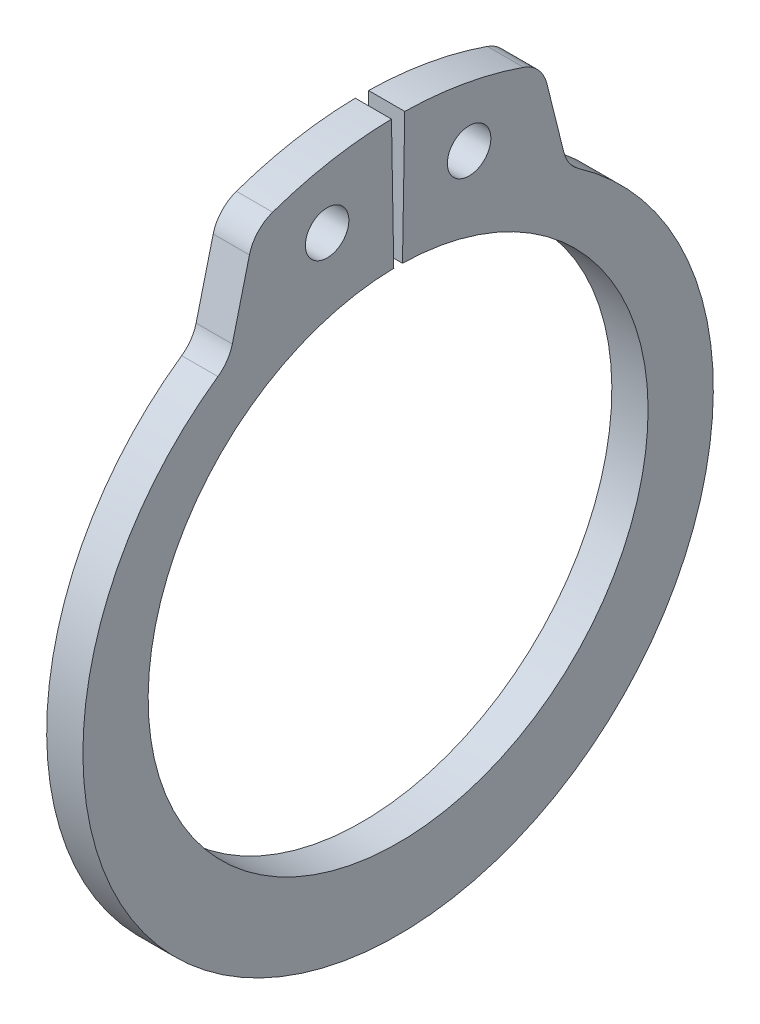
ISO-10303-21;
HEADER;
FILE_DESCRIPTION(('STEP AP214'),'2;1');
FILE_NAME('part.step','',(''),(''),'','','');
FILE_SCHEMA(('AUTOMOTIVE_DESIGN { 1 0 10303 214 1 1 1 1 }'));
ENDSEC;
DATA;
#1=APPLICATION_CONTEXT('core data for automotive mechanical design processes');
#2=APPLICATION_PROTOCOL_DEFINITION('international standard','automotive_design',2000,#1);
#3=PRODUCT_CONTEXT('',#1,'mechanical');
#4=PRODUCT('Part','Part','',(#3));
#5=PRODUCT_RELATED_PRODUCT_CATEGORY('part','',(#4));
#6=PRODUCT_DEFINITION_FORMATION('','',#4);
#7=PRODUCT_DEFINITION_CONTEXT('part definition',#1,'design');
#8=PRODUCT_DEFINITION('design','',#6,#7);
#9=PRODUCT_DEFINITION_SHAPE('','',#8);
#10=(LENGTH_UNIT() NAMED_UNIT(*) SI_UNIT(.MILLI.,.METRE.));
#11=(NAMED_UNIT(*) PLANE_ANGLE_UNIT() SI_UNIT($,.RADIAN.));
#12=(NAMED_UNIT(*) SI_UNIT($,.STERADIAN.) SOLID_ANGLE_UNIT());
#13=UNCERTAINTY_MEASURE_WITH_UNIT(LENGTH_MEASURE(1.E-05),#10,'distance_accuracy_value','');
#14=(GEOMETRIC_REPRESENTATION_CONTEXT(3) GLOBAL_UNCERTAINTY_ASSIGNED_CONTEXT((#13)) GLOBAL_UNIT_ASSIGNED_CONTEXT((#10,
#11,#12)) REPRESENTATION_CONTEXT('',''));
#15=CARTESIAN_POINT('',(0.,0.,0.));
#16=DIRECTION('',(0.,0.,1.));
#17=DIRECTION('',(1.,0.,0.));
#18=AXIS2_PLACEMENT_3D('',#15,#16,#17);
#19=CARTESIAN_POINT('',(-0.5,0.,0.));
#20=DIRECTION('',(1.,0.,0.));
#21=DIRECTION('',(0.,0.,-1.));
#22=AXIS2_PLACEMENT_3D('',#19,#20,#21);
#23=PLANE('',#22);
#24=CARTESIAN_POINT('',(-0.5,8.66711980549086,-1.9596288316201));
#25=DIRECTION('',(-1.,0.,0.));
#26=DIRECTION('',(0.,0.,1.));
#27=AXIS2_PLACEMENT_3D('',#24,#25,#26);
#28=CIRCLE('',#27,0.6);
#29=CARTESIAN_POINT('',(-0.5,8.66711980549086,-1.3596288316201));
#30=VERTEX_POINT('',#29);
#31=EDGE_CURVE('E125',#30,#30,#28,.F.);
#32=ORIENTED_EDGE('',*,*,#31,.T.);
#33=EDGE_LOOP('',(#32));
#34=FACE_BOUND('',#33,.T.);
#35=CARTESIAN_POINT('',(-0.5,8.96816184312502,3.13401869099666));
#36=DIRECTION('',(-1.,0.,0.));
#37=DIRECTION('',(0.,0.,1.));
#38=AXIS2_PLACEMENT_3D('',#35,#36,#37);
#39=CIRCLE('',#38,1.);
#40=CARTESIAN_POINT('',(-0.5,9.91217887924345,3.46391539531209));
#41=VERTEX_POINT('',#40);
#42=CARTESIAN_POINT('',(-0.5,9.21008373872469,4.10431441727265));
#43=VERTEX_POINT('',#42);
#44=EDGE_CURVE('E111',#41,#43,#39,.F.);
#45=ORIENTED_EDGE('',*,*,#44,.F.);
#46=CARTESIAN_POINT('',(-0.5,0.,0.));
#47=DIRECTION('',(-1.,0.,0.));
#48=DIRECTION('',(0.,0.,1.));
#49=AXIS2_PLACEMENT_3D('',#46,#47,#48);
#50=CIRCLE('',#49,10.5);
#51=CARTESIAN_POINT('',(-0.5,10.4984007991421,0.183250267591477));
#52=VERTEX_POINT('',#51);
#53=EDGE_CURVE('E104',#52,#41,#50,.F.);
#54=ORIENTED_EDGE('',*,*,#53,.F.);
#55=DIRECTION('',(0.,-0.999847695156391,-0.0174524064372835));
#56=VECTOR('',#55,1.);
#57=CARTESIAN_POINT('',(-0.5,6.8989490965791,0.120421604417256));
#58=LINE('',#57,#56);
#59=CARTESIAN_POINT('',(-0.5,6.8989490965791,0.120421604417256));
#60=VERTEX_POINT('',#59);
#61=EDGE_CURVE('E108',#52,#60,#58,.T.);
#62=ORIENTED_EDGE('',*,*,#61,.T.);
#63=CARTESIAN_POINT('',(-0.5,0.,0.));
#64=DIRECTION('',(-1.,0.,0.));
#65=DIRECTION('',(0.,0.,1.));
#66=AXIS2_PLACEMENT_3D('',#63,#64,#65);
#67=CIRCLE('',#66,6.9);
#68=CARTESIAN_POINT('',(-0.5,6.8989490965791,-0.120421604417256));
#69=VERTEX_POINT('',#68);
#70=EDGE_CURVE('E171',#60,#69,#67,.F.);
#71=ORIENTED_EDGE('',*,*,#70,.T.);
#72=DIRECTION('',(0.,0.999847695156391,-0.0174524064372841));
#73=VECTOR('',#72,1.);
#74=CARTESIAN_POINT('',(-0.5,10.4984007991421,-0.183250267591479));
#75=LINE('',#74,#73);
#76=CARTESIAN_POINT('',(-0.5,10.4984007991421,-0.183250267591479));
#77=VERTEX_POINT('',#76);
#78=EDGE_CURVE('E133',#69,#77,#75,.T.);
#79=ORIENTED_EDGE('',*,*,#78,.T.);
#80=CARTESIAN_POINT('',(-0.5,0.,0.));
#81=DIRECTION('',(-1.,0.,0.));
#82=DIRECTION('',(0.,0.,1.));
#83=AXIS2_PLACEMENT_3D('',#80,#81,#82);
#84=CIRCLE('',#83,10.5);
#85=CARTESIAN_POINT('',(-0.5,9.91217887924345,-3.46391539531209));
#86=VERTEX_POINT('',#85);
#87=EDGE_CURVE('E173',#86,#77,#84,.F.);
#88=ORIENTED_EDGE('',*,*,#87,.F.);
#89=CARTESIAN_POINT('',(-0.5,8.96816184312502,-3.13401869099665));
#90=DIRECTION('',(-1.,0.,0.));
#91=DIRECTION('',(0.,0.,1.));
#92=AXIS2_PLACEMENT_3D('',#89,#90,#91);
#93=CIRCLE('',#92,1.);
#94=CARTESIAN_POINT('',(-0.5,9.21008373872469,-4.10431441727265));
#95=VERTEX_POINT('',#94);
#96=EDGE_CURVE('E176',#95,#86,#93,.F.);
#97=ORIENTED_EDGE('',*,*,#96,.F.);
#98=DIRECTION('',(0.,-0.970295726275997,-0.241921895599666));
#99=VECTOR('',#98,1.);
#100=CARTESIAN_POINT('',(-0.5,9.71734472745919,-3.97784004803122));
#101=LINE('',#100,#99);
#102=CARTESIAN_POINT('',(-0.5,7.31761530924591,-4.57615979123836));
#103=VERTEX_POINT('',#102);
#104=EDGE_CURVE('E138',#95,#103,#101,.T.);
#105=ORIENTED_EDGE('',*,*,#104,.T.);
#106=CARTESIAN_POINT('',(-0.5,7.55953720484558,-5.54645551751436));
#107=DIRECTION('',(-1.,0.,0.));
#108=DIRECTION('',(0.,0.,1.));
#109=AXIS2_PLACEMENT_3D('',#106,#107,#108);
#110=CIRCLE('',#109,1.);
#111=CARTESIAN_POINT('',(-0.5,6.73911195964233,-4.97470170945253));
#112=VERTEX_POINT('',#111);
#113=EDGE_CURVE('E178',#103,#112,#110,.F.);
#114=ORIENTED_EDGE('',*,*,#113,.T.);
#115=CARTESIAN_POINT('',(-0.5,-0.399224177769538,0.));
#116=DIRECTION('',(-1.,0.,0.));
#117=DIRECTION('',(0.,0.,1.));
#118=AXIS2_PLACEMENT_3D('',#115,#116,#117);
#119=CIRCLE('',#118,8.70077582223046);
#120=CARTESIAN_POINT('',(-0.5,6.73911195964233,4.97470170945253));
#121=VERTEX_POINT('',#120);
#122=EDGE_CURVE('E181',#121,#112,#119,.F.);
#123=ORIENTED_EDGE('',*,*,#122,.F.);
#124=CARTESIAN_POINT('',(-0.5,7.55953720484558,5.54645551751436));
#125=DIRECTION('',(-1.,0.,0.));
#126=DIRECTION('',(0.,0.,1.));
#127=AXIS2_PLACEMENT_3D('',#124,#125,#126);
#128=CIRCLE('',#127,1.);
#129=CARTESIAN_POINT('',(-0.5,7.31761530924591,4.57615979123836));
#130=VERTEX_POINT('',#129);
#131=EDGE_CURVE('E144',#121,#130,#128,.F.);
#132=ORIENTED_EDGE('',*,*,#131,.T.);
#133=DIRECTION('',(0.,0.970295726275997,-0.241921895599665));
#134=VECTOR('',#133,1.);
#135=CARTESIAN_POINT('',(-0.5,9.71734472745919,3.97784004803122));
#136=LINE('',#135,#134);
#137=EDGE_CURVE('E143',#130,#43,#136,.T.);
#138=ORIENTED_EDGE('',*,*,#137,.T.);
#139=EDGE_LOOP('',(#45,#54,#62,#71,#79,#88,#97,#105,#114,#123,#132,#138));
#140=FACE_BOUND('',#139,.T.);
#141=CARTESIAN_POINT('',(-0.5,8.66711980549086,1.9596288316201));
#142=DIRECTION('',(-1.,0.,0.));
#143=DIRECTION('',(0.,0.,1.));
#144=AXIS2_PLACEMENT_3D('',#141,#142,#143);
#145=CIRCLE('',#144,0.6);
#146=CARTESIAN_POINT('',(-0.5,8.66711980549086,2.5596288316201));
#147=VERTEX_POINT('',#146);
#148=EDGE_CURVE('E19',#147,#147,#145,.F.);
#149=ORIENTED_EDGE('',*,*,#148,.T.);
#150=EDGE_LOOP('',(#149));
#151=FACE_BOUND('',#150,.T.);
#152=ADVANCED_FACE('F16',(#34,#140,#151),#23,.F.);
#153=CARTESIAN_POINT('',(0.5,8.66711980549086,1.9596288316201));
#154=DIRECTION('',(-1.,0.,0.));
#155=DIRECTION('',(0.,0.,1.));
#156=AXIS2_PLACEMENT_3D('',#153,#154,#155);
#157=CYLINDRICAL_SURFACE('',#156,0.6);
#158=CARTESIAN_POINT('',(0.5,8.66711980549086,1.9596288316201));
#159=DIRECTION('',(-1.,0.,0.));
#160=DIRECTION('',(0.,0.,1.));
#161=AXIS2_PLACEMENT_3D('',#158,#159,#160);
#162=CIRCLE('',#161,0.6);
#163=CARTESIAN_POINT('',(0.5,8.66711980549086,2.5596288316201));
#164=VERTEX_POINT('',#163);
#165=EDGE_CURVE('E128',#164,#164,#162,.T.);
#166=ORIENTED_EDGE('',*,*,#165,.F.);
#167=EDGE_LOOP('',(#166));
#168=FACE_BOUND('',#167,.T.);
#169=ORIENTED_EDGE('',*,*,#148,.F.);
#170=EDGE_LOOP('',(#169));
#171=FACE_BOUND('',#170,.T.);
#172=ADVANCED_FACE('F271',(#168,#171),#157,.F.);
#173=CARTESIAN_POINT('',(0.5,0.,0.));
#174=DIRECTION('',(-1.,0.,0.));
#175=DIRECTION('',(0.,0.,1.));
#176=AXIS2_PLACEMENT_3D('',#173,#174,#175);
#177=CYLINDRICAL_SURFACE('',#176,10.5);
#178=CARTESIAN_POINT('',(0.5,0.,0.));
#179=DIRECTION('',(-1.,0.,0.));
#180=DIRECTION('',(0.,0.,1.));
#181=AXIS2_PLACEMENT_3D('',#178,#179,#180);
#182=CIRCLE('',#181,10.5);
#183=CARTESIAN_POINT('',(0.5,10.4984007991421,0.183250267591477));
#184=VERTEX_POINT('',#183);
#185=CARTESIAN_POINT('',(0.5,9.91217887924345,3.46391539531209));
#186=VERTEX_POINT('',#185);
#187=EDGE_CURVE('E119',#184,#186,#182,.F.);
#188=ORIENTED_EDGE('',*,*,#187,.F.);
#189=DIRECTION('',(1.,0.,0.));
#190=VECTOR('',#189,1.);
#191=CARTESIAN_POINT('',(0.5,10.4984007991421,0.183250267591477));
#192=LINE('',#191,#190);
#193=EDGE_CURVE('E116',#184,#52,#192,.F.);
#194=ORIENTED_EDGE('',*,*,#193,.T.);
#195=ORIENTED_EDGE('',*,*,#53,.T.);
#196=DIRECTION('',(-1.,0.,0.));
#197=VECTOR('',#196,1.);
#198=CARTESIAN_POINT('',(0.5,9.91217887924345,3.46391539531209));
#199=LINE('',#198,#197);
#200=EDGE_CURVE('E114',#186,#41,#199,.T.);
#201=ORIENTED_EDGE('',*,*,#200,.F.);
#202=EDGE_LOOP('',(#188,#194,#195,#201));
#203=FACE_BOUND('',#202,.T.);
#204=ADVANCED_FACE('F117',(#203),#177,.T.);
#205=CARTESIAN_POINT('',(0.5,8.96816184312502,3.13401869099666));
#206=DIRECTION('',(-1.,0.,0.));
#207=DIRECTION('',(0.,0.,1.));
#208=AXIS2_PLACEMENT_3D('',#205,#206,#207);
#209=CYLINDRICAL_SURFACE('',#208,1.);
#210=ORIENTED_EDGE('',*,*,#44,.T.);
#211=DIRECTION('',(1.,0.,0.));
#212=VECTOR('',#211,1.);
#213=CARTESIAN_POINT('',(0.5,9.21008373872469,4.10431441727265));
#214=LINE('',#213,#212);
#215=CARTESIAN_POINT('',(0.5,9.21008373872469,4.10431441727265));
#216=VERTEX_POINT('',#215);
#217=EDGE_CURVE('E145',#43,#216,#214,.T.);
#218=ORIENTED_EDGE('',*,*,#217,.T.);
#219=CARTESIAN_POINT('',(0.5,8.96816184312502,3.13401869099666));
#220=DIRECTION('',(-1.,0.,0.));
#221=DIRECTION('',(0.,0.,1.));
#222=AXIS2_PLACEMENT_3D('',#219,#220,#221);
#223=CIRCLE('',#222,1.);
#224=EDGE_CURVE('E165',#186,#216,#223,.F.);
#225=ORIENTED_EDGE('',*,*,#224,.F.);
#226=ORIENTED_EDGE('',*,*,#200,.T.);
#227=EDGE_LOOP('',(#210,#218,#225,#226));
#228=FACE_BOUND('',#227,.T.);
#229=ADVANCED_FACE('F189',(#228),#209,.T.);
#230=CARTESIAN_POINT('',(0.5,9.71734472745919,3.97784004803122));
#231=DIRECTION('',(0.,-0.241921895599665,-0.970295726275997));
#232=DIRECTION('',(0.,0.970295726275997,-0.241921895599665));
#233=AXIS2_PLACEMENT_3D('',#230,#231,#232);
#234=PLANE('',#233);
#235=DIRECTION('',(-1.,0.,0.));
#236=VECTOR('',#235,1.);
#237=CARTESIAN_POINT('',(0.5,7.31761530924591,4.57615979123836));
#238=LINE('',#237,#236);
#239=CARTESIAN_POINT('',(0.5,7.31761530924591,4.57615979123836));
#240=VERTEX_POINT('',#239);
#241=EDGE_CURVE('E186',#130,#240,#238,.F.);
#242=ORIENTED_EDGE('',*,*,#241,.T.);
#243=DIRECTION('',(0.,-0.970295726275997,0.241921895599665));
#244=VECTOR('',#243,1.);
#245=CARTESIAN_POINT('',(0.5,9.21008373872469,4.10431441727265));
#246=LINE('',#245,#244);
#247=EDGE_CURVE('E164',#216,#240,#246,.T.);
#248=ORIENTED_EDGE('',*,*,#247,.F.);
#249=ORIENTED_EDGE('',*,*,#217,.F.);
#250=ORIENTED_EDGE('',*,*,#137,.F.);
#251=EDGE_LOOP('',(#242,#248,#249,#250));
#252=FACE_BOUND('',#251,.T.);
#253=ADVANCED_FACE('F217',(#252),#234,.F.);
#254=CARTESIAN_POINT('',(0.5,7.55953720484558,5.54645551751436));
#255=DIRECTION('',(-1.,0.,0.));
#256=DIRECTION('',(0.,0.,1.));
#257=AXIS2_PLACEMENT_3D('',#254,#255,#256);
#258=CYLINDRICAL_SURFACE('',#257,1.);
#259=ORIENTED_EDGE('',*,*,#241,.F.);
#260=ORIENTED_EDGE('',*,*,#131,.F.);
#261=DIRECTION('',(-1.,0.,0.));
#262=VECTOR('',#261,1.);
#263=CARTESIAN_POINT('',(0.5,6.73911195964233,4.97470170945253));
#264=LINE('',#263,#262);
#265=CARTESIAN_POINT('',(0.5,6.73911195964233,4.97470170945253));
#266=VERTEX_POINT('',#265);
#267=EDGE_CURVE('E184',#266,#121,#264,.T.);
#268=ORIENTED_EDGE('',*,*,#267,.F.);
#269=CARTESIAN_POINT('',(0.5,7.55953720484558,5.54645551751436));
#270=DIRECTION('',(-1.,0.,0.));
#271=DIRECTION('',(0.,0.,1.));
#272=AXIS2_PLACEMENT_3D('',#269,#270,#271);
#273=CIRCLE('',#272,1.);
#274=EDGE_CURVE('E161',#240,#266,#273,.T.);
#275=ORIENTED_EDGE('',*,*,#274,.F.);
#276=EDGE_LOOP('',(#259,#260,#268,#275));
#277=FACE_BOUND('',#276,.T.);
#278=ADVANCED_FACE('F220',(#277),#258,.F.);
#279=CARTESIAN_POINT('',(0.5,-0.399224177769538,0.));
#280=DIRECTION('',(-1.,0.,0.));
#281=DIRECTION('',(0.,0.,1.));
#282=AXIS2_PLACEMENT_3D('',#279,#280,#281);
#283=CYLINDRICAL_SURFACE('',#282,8.70077582223046);
#284=ORIENTED_EDGE('',*,*,#122,.T.);
#285=DIRECTION('',(-1.,0.,0.));
#286=VECTOR('',#285,1.);
#287=CARTESIAN_POINT('',(0.5,6.73911195964233,-4.97470170945253));
#288=LINE('',#287,#286);
#289=CARTESIAN_POINT('',(0.5,6.73911195964233,-4.97470170945253));
#290=VERTEX_POINT('',#289);
#291=EDGE_CURVE('E180',#112,#290,#288,.F.);
#292=ORIENTED_EDGE('',*,*,#291,.T.);
#293=CARTESIAN_POINT('',(0.5,-0.399224177769538,0.));
#294=DIRECTION('',(-1.,0.,0.));
#295=DIRECTION('',(0.,0.,1.));
#296=AXIS2_PLACEMENT_3D('',#293,#294,#295);
#297=CIRCLE('',#296,8.70077582223046);
#298=EDGE_CURVE('E159',#266,#290,#297,.F.);
#299=ORIENTED_EDGE('',*,*,#298,.F.);
#300=ORIENTED_EDGE('',*,*,#267,.T.);
#301=EDGE_LOOP('',(#284,#292,#299,#300));
#302=FACE_BOUND('',#301,.T.);
#303=ADVANCED_FACE('F225',(#302),#283,.T.);
#304=CARTESIAN_POINT('',(0.5,7.55953720484558,-5.54645551751436));
#305=DIRECTION('',(-1.,0.,0.));
#306=DIRECTION('',(0.,0.,1.));
#307=AXIS2_PLACEMENT_3D('',#304,#305,#306);
#308=CYLINDRICAL_SURFACE('',#307,1.);
#309=ORIENTED_EDGE('',*,*,#291,.F.);
#310=ORIENTED_EDGE('',*,*,#113,.F.);
#311=DIRECTION('',(1.,0.,0.));
#312=VECTOR('',#311,1.);
#313=CARTESIAN_POINT('',(0.5,7.31761530924591,-4.57615979123836));
#314=LINE('',#313,#312);
#315=CARTESIAN_POINT('',(0.5,7.31761530924591,-4.57615979123836));
#316=VERTEX_POINT('',#315);
#317=EDGE_CURVE('E142',#103,#316,#314,.T.);
#318=ORIENTED_EDGE('',*,*,#317,.T.);
#319=CARTESIAN_POINT('',(0.5,7.55953720484558,-5.54645551751436));
#320=DIRECTION('',(-1.,0.,0.));
#321=DIRECTION('',(0.,0.,1.));
#322=AXIS2_PLACEMENT_3D('',#319,#320,#321);
#323=CIRCLE('',#322,1.);
#324=EDGE_CURVE('E156',#290,#316,#323,.T.);
#325=ORIENTED_EDGE('',*,*,#324,.F.);
#326=EDGE_LOOP('',(#309,#310,#318,#325));
#327=FACE_BOUND('',#326,.T.);
#328=ADVANCED_FACE('F227',(#327),#308,.F.);
#329=CARTESIAN_POINT('',(0.5,9.71734472745919,-3.97784004803122));
#330=DIRECTION('',(0.,-0.241921895599666,0.970295726275997));
#331=DIRECTION('',(0.,-0.970295726275997,-0.241921895599666));
#332=AXIS2_PLACEMENT_3D('',#329,#330,#331);
#333=PLANE('',#332);
#334=DIRECTION('',(-1.,0.,0.));
#335=VECTOR('',#334,1.);
#336=CARTESIAN_POINT('',(0.5,9.21008373872469,-4.10431441727265));
#337=LINE('',#336,#335);
#338=CARTESIAN_POINT('',(0.5,9.21008373872469,-4.10431441727265));
#339=VERTEX_POINT('',#338);
#340=EDGE_CURVE('E141',#339,#95,#337,.T.);
#341=ORIENTED_EDGE('',*,*,#340,.F.);
#342=DIRECTION('',(0.,0.970295726275997,0.241921895599666));
#343=VECTOR('',#342,1.);
#344=CARTESIAN_POINT('',(0.5,7.31761530924591,-4.57615979123836));
#345=LINE('',#344,#343);
#346=EDGE_CURVE('E155',#316,#339,#345,.T.);
#347=ORIENTED_EDGE('',*,*,#346,.F.);
#348=ORIENTED_EDGE('',*,*,#317,.F.);
#349=ORIENTED_EDGE('',*,*,#104,.F.);
#350=EDGE_LOOP('',(#341,#347,#348,#349));
#351=FACE_BOUND('',#350,.T.);
#352=ADVANCED_FACE('F231',(#351),#333,.F.);
#353=CARTESIAN_POINT('',(0.5,8.96816184312502,-3.13401869099665));
#354=DIRECTION('',(-1.,0.,0.));
#355=DIRECTION('',(0.,0.,1.));
#356=AXIS2_PLACEMENT_3D('',#353,#354,#355);
#357=CYLINDRICAL_SURFACE('',#356,1.);
#358=ORIENTED_EDGE('',*,*,#96,.T.);
#359=DIRECTION('',(-1.,0.,0.));
#360=VECTOR('',#359,1.);
#361=CARTESIAN_POINT('',(0.5,9.91217887924345,-3.46391539531209));
#362=LINE('',#361,#360);
#363=CARTESIAN_POINT('',(0.5,9.91217887924345,-3.46391539531209));
#364=VERTEX_POINT('',#363);
#365=EDGE_CURVE('E175',#364,#86,#362,.T.);
#366=ORIENTED_EDGE('',*,*,#365,.F.);
#367=CARTESIAN_POINT('',(0.5,8.96816184312502,-3.13401869099665));
#368=DIRECTION('',(-1.,0.,0.));
#369=DIRECTION('',(0.,0.,1.));
#370=AXIS2_PLACEMENT_3D('',#367,#368,#369);
#371=CIRCLE('',#370,1.);
#372=EDGE_CURVE('E152',#339,#364,#371,.F.);
#373=ORIENTED_EDGE('',*,*,#372,.F.);
#374=ORIENTED_EDGE('',*,*,#340,.T.);
#375=EDGE_LOOP('',(#358,#366,#373,#374));
#376=FACE_BOUND('',#375,.T.);
#377=ADVANCED_FACE('F235',(#376),#357,.T.);
#378=CARTESIAN_POINT('',(0.5,0.,0.));
#379=DIRECTION('',(-1.,0.,0.));
#380=DIRECTION('',(0.,0.,1.));
#381=AXIS2_PLACEMENT_3D('',#378,#379,#380);
#382=CYLINDRICAL_SURFACE('',#381,10.5);
#383=ORIENTED_EDGE('',*,*,#87,.T.);
#384=DIRECTION('',(1.,0.,0.));
#385=VECTOR('',#384,1.);
#386=CARTESIAN_POINT('',(0.5,10.4984007991421,-0.183250267591479));
#387=LINE('',#386,#385);
#388=CARTESIAN_POINT('',(0.5,10.4984007991421,-0.183250267591479));
#389=VERTEX_POINT('',#388);
#390=EDGE_CURVE('E137',#77,#389,#387,.T.);
#391=ORIENTED_EDGE('',*,*,#390,.T.);
#392=CARTESIAN_POINT('',(0.5,0.,0.));
#393=DIRECTION('',(-1.,0.,0.));
#394=DIRECTION('',(0.,0.,1.));
#395=AXIS2_PLACEMENT_3D('',#392,#393,#394);
#396=CIRCLE('',#395,10.5);
#397=EDGE_CURVE('E149',#364,#389,#396,.F.);
#398=ORIENTED_EDGE('',*,*,#397,.F.);
#399=ORIENTED_EDGE('',*,*,#365,.T.);
#400=EDGE_LOOP('',(#383,#391,#398,#399));
#401=FACE_BOUND('',#400,.T.);
#402=ADVANCED_FACE('F239',(#401),#382,.T.);
#403=CARTESIAN_POINT('',(0.5,10.4984007991421,-0.183250267591479));
#404=DIRECTION('',(0.,-0.0174524064372841,-0.999847695156391));
#405=DIRECTION('',(0.,0.999847695156391,-0.0174524064372841));
#406=AXIS2_PLACEMENT_3D('',#403,#404,#405);
#407=PLANE('',#406);
#408=DIRECTION('',(-1.,0.,0.));
#409=VECTOR('',#408,1.);
#410=CARTESIAN_POINT('',(0.5,6.8989490965791,-0.120421604417256));
#411=LINE('',#410,#409);
#412=CARTESIAN_POINT('',(0.5,6.8989490965791,-0.120421604417256));
#413=VERTEX_POINT('',#412);
#414=EDGE_CURVE('E136',#69,#413,#411,.F.);
#415=ORIENTED_EDGE('',*,*,#414,.T.);
#416=DIRECTION('',(0.,-0.999847695156391,0.017452406437284));
#417=VECTOR('',#416,1.);
#418=CARTESIAN_POINT('',(0.5,10.4984007991421,-0.183250267591479));
#419=LINE('',#418,#417);
#420=EDGE_CURVE('E148',#389,#413,#419,.T.);
#421=ORIENTED_EDGE('',*,*,#420,.F.);
#422=ORIENTED_EDGE('',*,*,#390,.F.);
#423=ORIENTED_EDGE('',*,*,#78,.F.);
#424=EDGE_LOOP('',(#415,#421,#422,#423));
#425=FACE_BOUND('',#424,.T.);
#426=ADVANCED_FACE('F244',(#425),#407,.F.);
#427=CARTESIAN_POINT('',(0.5,0.,0.));
#428=DIRECTION('',(-1.,0.,0.));
#429=DIRECTION('',(0.,0.,1.));
#430=AXIS2_PLACEMENT_3D('',#427,#428,#429);
#431=CYLINDRICAL_SURFACE('',#430,6.9);
#432=DIRECTION('',(1.,0.,0.));
#433=VECTOR('',#432,1.);
#434=CARTESIAN_POINT('',(0.5,6.8989490965791,0.120421604417256));
#435=LINE('',#434,#433);
#436=CARTESIAN_POINT('',(0.5,6.8989490965791,0.120421604417256));
#437=VERTEX_POINT('',#436);
#438=EDGE_CURVE('E122',#60,#437,#435,.T.);
#439=ORIENTED_EDGE('',*,*,#438,.T.);
#440=CARTESIAN_POINT('',(0.5,0.,0.));
#441=DIRECTION('',(-1.,0.,0.));
#442=DIRECTION('',(0.,0.,1.));
#443=AXIS2_PLACEMENT_3D('',#440,#441,#442);
#444=CIRCLE('',#443,6.9);
#445=EDGE_CURVE('E34',#413,#437,#444,.T.);
#446=ORIENTED_EDGE('',*,*,#445,.F.);
#447=ORIENTED_EDGE('',*,*,#414,.F.);
#448=ORIENTED_EDGE('',*,*,#70,.F.);
#449=EDGE_LOOP('',(#439,#446,#447,#448));
#450=FACE_BOUND('',#449,.T.);
#451=ADVANCED_FACE('F247',(#450),#431,.F.);
#452=CARTESIAN_POINT('',(0.5,6.8989490965791,0.120421604417256));
#453=DIRECTION('',(0.,-0.0174524064372835,0.999847695156391));
#454=DIRECTION('',(0.,-0.999847695156391,-0.0174524064372835));
#455=AXIS2_PLACEMENT_3D('',#452,#453,#454);
#456=PLANE('',#455);
#457=ORIENTED_EDGE('',*,*,#193,.F.);
#458=DIRECTION('',(0.,0.999847695156391,0.0174524064372835));
#459=VECTOR('',#458,1.);
#460=CARTESIAN_POINT('',(0.5,6.8989490965791,0.120421604417256));
#461=LINE('',#460,#459);
#462=EDGE_CURVE('E25',#437,#184,#461,.T.);
#463=ORIENTED_EDGE('',*,*,#462,.F.);
#464=ORIENTED_EDGE('',*,*,#438,.F.);
#465=ORIENTED_EDGE('',*,*,#61,.F.);
#466=EDGE_LOOP('',(#457,#463,#464,#465));
#467=FACE_BOUND('',#466,.T.);
#468=ADVANCED_FACE('F124',(#467),#456,.F.);
#469=CARTESIAN_POINT('',(0.5,8.66711980549086,-1.9596288316201));
#470=DIRECTION('',(-1.,0.,0.));
#471=DIRECTION('',(0.,0.,1.));
#472=AXIS2_PLACEMENT_3D('',#469,#470,#471);
#473=CYLINDRICAL_SURFACE('',#472,0.6);
#474=CARTESIAN_POINT('',(0.5,8.66711980549086,-1.9596288316201));
#475=DIRECTION('',(-1.,0.,0.));
#476=DIRECTION('',(0.,0.,1.));
#477=AXIS2_PLACEMENT_3D('',#474,#475,#476);
#478=CIRCLE('',#477,0.6);
#479=CARTESIAN_POINT('',(0.5,8.66711980549086,-1.3596288316201));
#480=VERTEX_POINT('',#479);
#481=EDGE_CURVE('E11',#480,#480,#478,.T.);
#482=ORIENTED_EDGE('',*,*,#481,.F.);
#483=EDGE_LOOP('',(#482));
#484=FACE_BOUND('',#483,.T.);
#485=ORIENTED_EDGE('',*,*,#31,.F.);
#486=EDGE_LOOP('',(#485));
#487=FACE_BOUND('',#486,.T.);
#488=ADVANCED_FACE('F255',(#484,#487),#473,.F.);
#489=CARTESIAN_POINT('',(0.5,0.,0.));
#490=DIRECTION('',(1.,0.,0.));
#491=DIRECTION('',(0.,0.,-1.));
#492=AXIS2_PLACEMENT_3D('',#489,#490,#491);
#493=PLANE('',#492);
#494=ORIENTED_EDGE('',*,*,#481,.T.);
#495=EDGE_LOOP('',(#494));
#496=FACE_BOUND('',#495,.T.);
#497=ORIENTED_EDGE('',*,*,#445,.T.);
#498=ORIENTED_EDGE('',*,*,#462,.T.);
#499=ORIENTED_EDGE('',*,*,#187,.T.);
#500=ORIENTED_EDGE('',*,*,#224,.T.);
#501=ORIENTED_EDGE('',*,*,#247,.T.);
#502=ORIENTED_EDGE('',*,*,#274,.T.);
#503=ORIENTED_EDGE('',*,*,#298,.T.);
#504=ORIENTED_EDGE('',*,*,#324,.T.);
#505=ORIENTED_EDGE('',*,*,#346,.T.);
#506=ORIENTED_EDGE('',*,*,#372,.T.);
#507=ORIENTED_EDGE('',*,*,#397,.T.);
#508=ORIENTED_EDGE('',*,*,#420,.T.);
#509=EDGE_LOOP('',(#497,#498,#499,#500,#501,#502,#503,#504,#505,#506,#507,#508));
#510=FACE_BOUND('',#509,.T.);
#511=ORIENTED_EDGE('',*,*,#165,.T.);
#512=EDGE_LOOP('',(#511));
#513=FACE_BOUND('',#512,.T.);
#514=ADVANCED_FACE('F193',(#496,#510,#513),#493,.T.);
#515=CLOSED_SHELL('',(#152,#172,#204,#229,#253,#278,#303,#328,#352,#377,#402,#426,#451,#468,
#488,#514));
#516=MANIFOLD_SOLID_BREP('B1',#515);
#517=ADVANCED_BREP_SHAPE_REPRESENTATION('',(#18,#516),#14);
#518=SHAPE_DEFINITION_REPRESENTATION(#9,#517);
ENDSEC;
END-ISO-10303-21;
